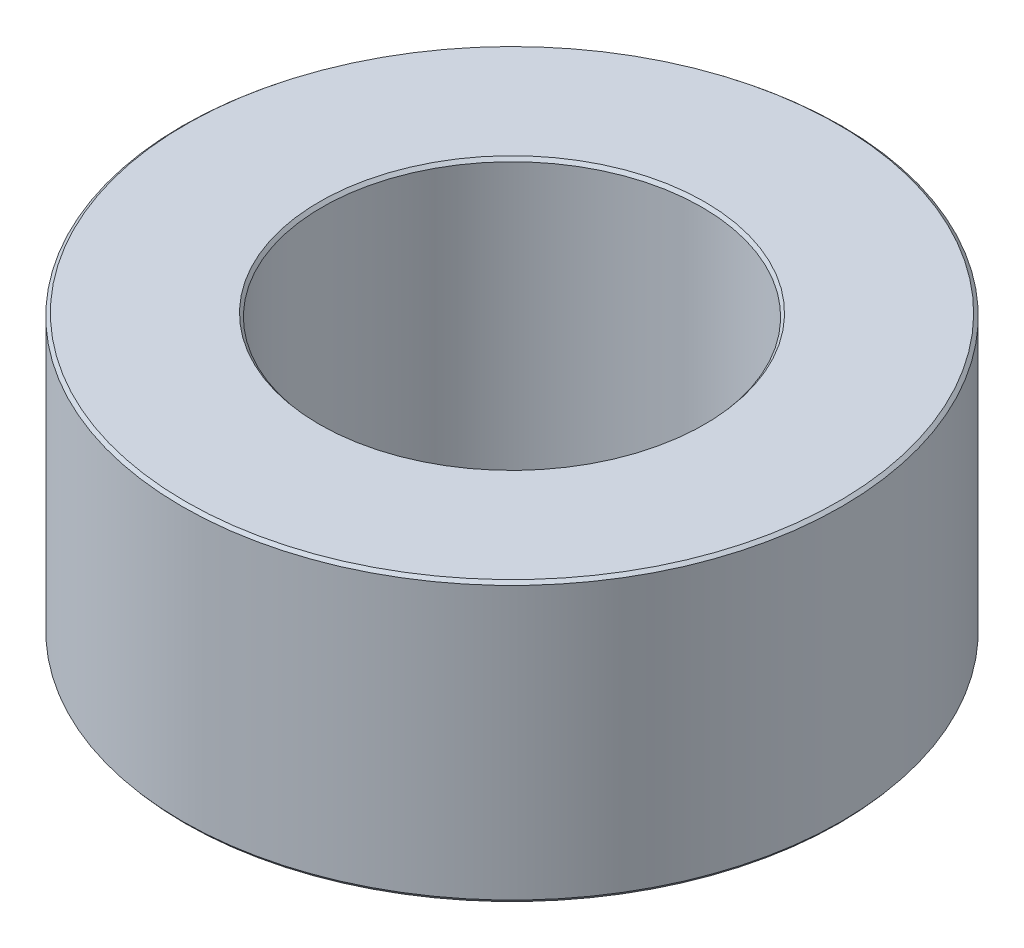
ISO-10303-21;
HEADER;
FILE_DESCRIPTION(('STEP AP214'),'2;1');
FILE_NAME('part.step','',(''),(''),'','','');
FILE_SCHEMA(('AUTOMOTIVE_DESIGN { 1 0 10303 214 1 1 1 1 }'));
ENDSEC;
DATA;
#1=APPLICATION_CONTEXT('core data for automotive mechanical design processes');
#2=APPLICATION_PROTOCOL_DEFINITION('international standard','automotive_design',2000,#1);
#3=PRODUCT_CONTEXT('',#1,'mechanical');
#4=PRODUCT('Part','Part','',(#3));
#5=PRODUCT_RELATED_PRODUCT_CATEGORY('part','',(#4));
#6=PRODUCT_DEFINITION_FORMATION('','',#4);
#7=PRODUCT_DEFINITION_CONTEXT('part definition',#1,'design');
#8=PRODUCT_DEFINITION('design','',#6,#7);
#9=PRODUCT_DEFINITION_SHAPE('','',#8);
#10=(LENGTH_UNIT() NAMED_UNIT(*) SI_UNIT(.MILLI.,.METRE.));
#11=(NAMED_UNIT(*) PLANE_ANGLE_UNIT() SI_UNIT($,.RADIAN.));
#12=(NAMED_UNIT(*) SI_UNIT($,.STERADIAN.) SOLID_ANGLE_UNIT());
#13=UNCERTAINTY_MEASURE_WITH_UNIT(LENGTH_MEASURE(1.E-05),#10,'distance_accuracy_value','');
#14=(GEOMETRIC_REPRESENTATION_CONTEXT(3) GLOBAL_UNCERTAINTY_ASSIGNED_CONTEXT((#13)) GLOBAL_UNIT_ASSIGNED_CONTEXT((#10,
#11,#12)) REPRESENTATION_CONTEXT('',''));
#15=CARTESIAN_POINT('',(0.,0.,0.));
#16=DIRECTION('',(0.,0.,1.));
#17=DIRECTION('',(1.,0.,0.));
#18=AXIS2_PLACEMENT_3D('',#15,#16,#17);
#19=CARTESIAN_POINT('',(0.,31.6751960239057,0.));
#20=DIRECTION('',(0.,-1.,0.));
#21=DIRECTION('',(0.,0.,-1.));
#22=AXIS2_PLACEMENT_3D('',#19,#20,#21);
#23=CYLINDRICAL_SURFACE('',#22,37.5);
#24=CARTESIAN_POINT('',(0.,0.371240717536213,0.));
#25=DIRECTION('',(0.,1.,0.));
#26=DIRECTION('',(0.,0.,1.));
#27=AXIS2_PLACEMENT_3D('',#24,#25,#26);
#28=CIRCLE('',#27,37.5);
#29=CARTESIAN_POINT('',(0.,0.371240717536213,37.5));
#30=VERTEX_POINT('',#29);
#31=EDGE_CURVE('E10',#30,#30,#28,.T.);
#32=ORIENTED_EDGE('',*,*,#31,.T.);
#33=EDGE_LOOP('',(#32));
#34=FACE_BOUND('',#33,.T.);
#35=CARTESIAN_POINT('',(0.,31.3619541775669,0.));
#36=DIRECTION('',(0.,1.,0.));
#37=DIRECTION('',(0.,0.,1.));
#38=AXIS2_PLACEMENT_3D('',#35,#36,#37);
#39=CIRCLE('',#38,37.5);
#40=CARTESIAN_POINT('',(0.,31.3619541775669,37.5));
#41=VERTEX_POINT('',#40);
#42=EDGE_CURVE('E50',#41,#41,#39,.F.);
#43=ORIENTED_EDGE('',*,*,#42,.T.);
#44=EDGE_LOOP('',(#43));
#45=FACE_BOUND('',#44,.T.);
#46=ADVANCED_FACE('F39',(#34,#45),#23,.T.);
#47=CARTESIAN_POINT('',(0.,31.6751960239057,0.));
#48=DIRECTION('',(0.,1.,0.));
#49=DIRECTION('',(0.,0.,1.));
#50=AXIS2_PLACEMENT_3D('',#47,#48,#49);
#51=PLANE('',#50);
#52=CARTESIAN_POINT('',(0.,31.6751960239057,0.));
#53=DIRECTION('',(0.,1.,0.));
#54=DIRECTION('',(0.,0.,1.));
#55=AXIS2_PLACEMENT_3D('',#52,#53,#54);
#56=CIRCLE('',#55,21.9210741411369);
#57=CARTESIAN_POINT('',(0.,31.6751960239057,21.9210741411369));
#58=VERTEX_POINT('',#57);
#59=EDGE_CURVE('E58',#58,#58,#56,.F.);
#60=ORIENTED_EDGE('',*,*,#59,.T.);
#61=EDGE_LOOP('',(#60));
#62=FACE_BOUND('',#61,.T.);
#63=CARTESIAN_POINT('',(0.,31.6751960239057,0.));
#64=DIRECTION('',(0.,1.,0.));
#65=DIRECTION('',(0.,0.,1.));
#66=AXIS2_PLACEMENT_3D('',#63,#64,#65);
#67=CIRCLE('',#66,37.1287592824638);
#68=CARTESIAN_POINT('',(0.,31.6751960239057,37.1287592824638));
#69=VERTEX_POINT('',#68);
#70=EDGE_CURVE('E61',#69,#69,#67,.T.);
#71=ORIENTED_EDGE('',*,*,#70,.T.);
#72=EDGE_LOOP('',(#71));
#73=FACE_BOUND('',#72,.T.);
#74=ADVANCED_FACE('F88',(#62,#73),#51,.T.);
#75=CARTESIAN_POINT('',(0.,0.,0.));
#76=DIRECTION('',(0.,1.,0.));
#77=DIRECTION('',(0.,0.,1.));
#78=AXIS2_PLACEMENT_3D('',#75,#76,#77);
#79=PLANE('',#78);
#80=CARTESIAN_POINT('',(0.,0.,0.));
#81=DIRECTION('',(0.,1.,0.));
#82=DIRECTION('',(0.,0.,1.));
#83=AXIS2_PLACEMENT_3D('',#80,#81,#82);
#84=CIRCLE('',#83,21.9790730123344);
#85=CARTESIAN_POINT('',(0.,0.,21.9790730123344));
#86=VERTEX_POINT('',#85);
#87=EDGE_CURVE('E51',#86,#86,#84,.T.);
#88=ORIENTED_EDGE('',*,*,#87,.T.);
#89=EDGE_LOOP('',(#88));
#90=FACE_BOUND('',#89,.T.);
#91=CARTESIAN_POINT('',(0.,0.,0.));
#92=DIRECTION('',(0.,1.,0.));
#93=DIRECTION('',(0.,0.,1.));
#94=AXIS2_PLACEMENT_3D('',#91,#92,#93);
#95=CIRCLE('',#94,37.1867581536613);
#96=CARTESIAN_POINT('',(0.,0.,37.1867581536613));
#97=VERTEX_POINT('',#96);
#98=EDGE_CURVE('E54',#97,#97,#95,.F.);
#99=ORIENTED_EDGE('',*,*,#98,.T.);
#100=EDGE_LOOP('',(#99));
#101=FACE_BOUND('',#100,.T.);
#102=ADVANCED_FACE('F83',(#90,#101),#79,.F.);
#103=CARTESIAN_POINT('',(0.,31.6751960239057,0.));
#104=DIRECTION('',(0.,-1.,0.));
#105=DIRECTION('',(0.,0.,-1.));
#106=AXIS2_PLACEMENT_3D('',#103,#104,#105);
#107=CYLINDRICAL_SURFACE('',#106,21.6078322947982);
#108=CARTESIAN_POINT('',(0.,31.3039553063695,0.));
#109=DIRECTION('',(0.,1.,0.));
#110=DIRECTION('',(0.,0.,1.));
#111=AXIS2_PLACEMENT_3D('',#108,#109,#110);
#112=CIRCLE('',#111,21.6078322947982);
#113=CARTESIAN_POINT('',(0.,31.3039553063695,21.6078322947982));
#114=VERTEX_POINT('',#113);
#115=EDGE_CURVE('E67',#114,#114,#112,.T.);
#116=ORIENTED_EDGE('',*,*,#115,.T.);
#117=EDGE_LOOP('',(#116));
#118=FACE_BOUND('',#117,.T.);
#119=CARTESIAN_POINT('',(0.,0.313241846338692,0.));
#120=DIRECTION('',(0.,1.,0.));
#121=DIRECTION('',(0.,0.,1.));
#122=AXIS2_PLACEMENT_3D('',#119,#120,#121);
#123=CIRCLE('',#122,21.6078322947982);
#124=CARTESIAN_POINT('',(0.,0.313241846338692,21.6078322947982));
#125=VERTEX_POINT('',#124);
#126=EDGE_CURVE('E69',#125,#125,#123,.F.);
#127=ORIENTED_EDGE('',*,*,#126,.T.);
#128=EDGE_LOOP('',(#127));
#129=FACE_BOUND('',#128,.T.);
#130=ADVANCED_FACE('F71',(#118,#129),#107,.F.);
#131=CARTESIAN_POINT('',(0.,31.3039553063695,0.));
#132=DIRECTION('',(0.,1.,0.));
#133=DIRECTION('',(0.,0.,1.));
#134=AXIS2_PLACEMENT_3D('',#131,#132,#133);
#135=CONICAL_SURFACE('',#134,21.6078322947982,0.700866194609031);
#136=ORIENTED_EDGE('',*,*,#59,.F.);
#137=EDGE_LOOP('',(#136));
#138=FACE_BOUND('',#137,.T.);
#139=ORIENTED_EDGE('',*,*,#115,.F.);
#140=EDGE_LOOP('',(#139));
#141=FACE_BOUND('',#140,.T.);
#142=ADVANCED_FACE('F77',(#138,#141),#135,.F.);
#143=CARTESIAN_POINT('',(0.,0.,0.));
#144=DIRECTION('',(0.,-1.,0.));
#145=DIRECTION('',(0.,0.,-1.));
#146=AXIS2_PLACEMENT_3D('',#143,#144,#145);
#147=CONICAL_SURFACE('',#146,21.9790730123344,0.869930132185888);
#148=ORIENTED_EDGE('',*,*,#126,.F.);
#149=EDGE_LOOP('',(#148));
#150=FACE_BOUND('',#149,.T.);
#151=ORIENTED_EDGE('',*,*,#87,.F.);
#152=EDGE_LOOP('',(#151));
#153=FACE_BOUND('',#152,.T.);
#154=ADVANCED_FACE('F73',(#150,#153),#147,.F.);
#155=CARTESIAN_POINT('',(0.,0.371240717536213,0.));
#156=DIRECTION('',(0.,1.,0.));
#157=DIRECTION('',(0.,0.,1.));
#158=AXIS2_PLACEMENT_3D('',#155,#156,#157);
#159=CONICAL_SURFACE('',#158,37.5,0.700866194609012);
#160=ORIENTED_EDGE('',*,*,#98,.F.);
#161=EDGE_LOOP('',(#160));
#162=FACE_BOUND('',#161,.T.);
#163=ORIENTED_EDGE('',*,*,#31,.F.);
#164=EDGE_LOOP('',(#163));
#165=FACE_BOUND('',#164,.T.);
#166=ADVANCED_FACE('F76',(#162,#165),#159,.T.);
#167=CARTESIAN_POINT('',(0.,31.6751960239057,0.));
#168=DIRECTION('',(0.,-1.,0.));
#169=DIRECTION('',(0.,0.,-1.));
#170=AXIS2_PLACEMENT_3D('',#167,#168,#169);
#171=CONICAL_SURFACE('',#170,37.1287592824638,0.869930132185883);
#172=ORIENTED_EDGE('',*,*,#42,.F.);
#173=EDGE_LOOP('',(#172));
#174=FACE_BOUND('',#173,.T.);
#175=ORIENTED_EDGE('',*,*,#70,.F.);
#176=EDGE_LOOP('',(#175));
#177=FACE_BOUND('',#176,.T.);
#178=ADVANCED_FACE('F45',(#174,#177),#171,.T.);
#179=CLOSED_SHELL('',(#46,#74,#102,#130,#142,#154,#166,#178));
#180=MANIFOLD_SOLID_BREP('B2',#179);
#181=ADVANCED_BREP_SHAPE_REPRESENTATION('',(#18,#180),#14);
#182=SHAPE_DEFINITION_REPRESENTATION(#9,#181);
ENDSEC;
END-ISO-10303-21;
